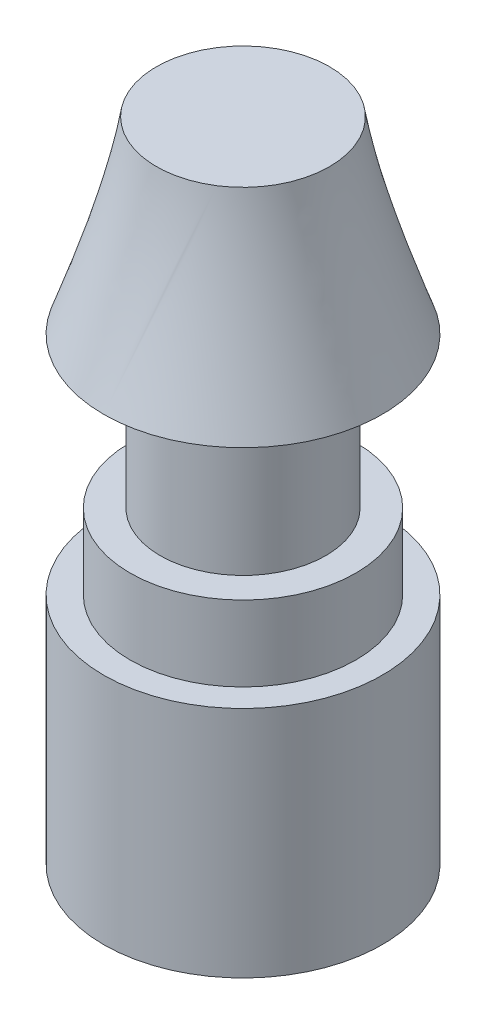
ISO-10303-21;
HEADER;
FILE_DESCRIPTION(('STEP AP214'),'2;1');
FILE_NAME('part.step','',(''),(''),'','','');
FILE_SCHEMA(('AUTOMOTIVE_DESIGN { 1 0 10303 214 1 1 1 1 }'));
ENDSEC;
DATA;
#1=APPLICATION_CONTEXT('core data for automotive mechanical design processes');
#2=APPLICATION_PROTOCOL_DEFINITION('international standard','automotive_design',2000,#1);
#3=PRODUCT_CONTEXT('',#1,'mechanical');
#4=PRODUCT('Part','Part','',(#3));
#5=PRODUCT_RELATED_PRODUCT_CATEGORY('part','',(#4));
#6=PRODUCT_DEFINITION_FORMATION('','',#4);
#7=PRODUCT_DEFINITION_CONTEXT('part definition',#1,'design');
#8=PRODUCT_DEFINITION('design','',#6,#7);
#9=PRODUCT_DEFINITION_SHAPE('','',#8);
#10=(LENGTH_UNIT() NAMED_UNIT(*) SI_UNIT(.MILLI.,.METRE.));
#11=(NAMED_UNIT(*) PLANE_ANGLE_UNIT() SI_UNIT($,.RADIAN.));
#12=(NAMED_UNIT(*) SI_UNIT($,.STERADIAN.) SOLID_ANGLE_UNIT());
#13=UNCERTAINTY_MEASURE_WITH_UNIT(LENGTH_MEASURE(1.E-05),#10,'distance_accuracy_value','');
#14=(GEOMETRIC_REPRESENTATION_CONTEXT(3) GLOBAL_UNCERTAINTY_ASSIGNED_CONTEXT((#13)) GLOBAL_UNIT_ASSIGNED_CONTEXT((#10,
#11,#12)) REPRESENTATION_CONTEXT('',''));
#15=CARTESIAN_POINT('',(0.,0.,0.));
#16=DIRECTION('',(0.,0.,1.));
#17=DIRECTION('',(1.,0.,0.));
#18=AXIS2_PLACEMENT_3D('',#15,#16,#17);
#19=CARTESIAN_POINT('',(0.,3.1,0.));
#20=DIRECTION('',(0.,-1.,0.));
#21=DIRECTION('',(0.,0.,-1.));
#22=AXIS2_PLACEMENT_3D('',#19,#20,#21);
#23=CYLINDRICAL_SURFACE('',#22,1.85);
#24=CARTESIAN_POINT('',(0.,3.1,0.));
#25=DIRECTION('',(0.,1.,0.));
#26=DIRECTION('',(0.,0.,1.));
#27=AXIS2_PLACEMENT_3D('',#24,#25,#26);
#28=CIRCLE('',#27,1.85);
#29=CARTESIAN_POINT('',(0.,3.1,-1.85));
#30=VERTEX_POINT('',#29);
#31=EDGE_CURVE('E47',#30,#30,#28,.T.);
#32=CARTESIAN_POINT('',(0.,0.,0.));
#33=DIRECTION('',(0.,1.,0.));
#34=DIRECTION('',(0.,0.,1.));
#35=AXIS2_PLACEMENT_3D('',#32,#33,#34);
#36=CIRCLE('',#35,1.85);
#37=CARTESIAN_POINT('',(0.,0.,-1.85));
#38=VERTEX_POINT('',#37);
#39=EDGE_CURVE('E38',#38,#38,#36,.T.);
#40=CARTESIAN_POINT('',(0.,3.1,-1.85));
#41=CARTESIAN_POINT('',(0.,3.06770833333333,-1.85));
#42=CARTESIAN_POINT('',(0.,3.03541666666667,-1.85));
#43=CARTESIAN_POINT('',(0.,2.97083333333333,-1.85));
#44=CARTESIAN_POINT('',(0.,2.93854166666667,-1.85));
#45=CARTESIAN_POINT('',(0.,2.87395833333333,-1.85));
#46=CARTESIAN_POINT('',(0.,2.84166666666667,-1.85));
#47=CARTESIAN_POINT('',(0.,2.77708333333333,-1.85));
#48=CARTESIAN_POINT('',(0.,2.74479166666667,-1.85));
#49=CARTESIAN_POINT('',(0.,2.68020833333333,-1.85));
#50=CARTESIAN_POINT('',(0.,2.64791666666667,-1.85));
#51=CARTESIAN_POINT('',(0.,2.58333333333333,-1.85));
#52=CARTESIAN_POINT('',(0.,2.55104166666667,-1.85));
#53=CARTESIAN_POINT('',(0.,2.48645833333333,-1.85));
#54=CARTESIAN_POINT('',(0.,2.45416666666667,-1.85));
#55=CARTESIAN_POINT('',(0.,2.38958333333333,-1.85));
#56=CARTESIAN_POINT('',(0.,2.35729166666667,-1.85));
#57=CARTESIAN_POINT('',(0.,2.29270833333333,-1.85));
#58=CARTESIAN_POINT('',(0.,2.26041666666667,-1.85));
#59=CARTESIAN_POINT('',(0.,2.19583333333333,-1.85));
#60=CARTESIAN_POINT('',(0.,2.16354166666667,-1.85));
#61=CARTESIAN_POINT('',(0.,2.09895833333333,-1.85));
#62=CARTESIAN_POINT('',(0.,2.06666666666667,-1.85));
#63=CARTESIAN_POINT('',(0.,2.00208333333333,-1.85));
#64=CARTESIAN_POINT('',(0.,1.96979166666667,-1.85));
#65=CARTESIAN_POINT('',(0.,1.90520833333333,-1.85));
#66=CARTESIAN_POINT('',(0.,1.87291666666667,-1.85));
#67=CARTESIAN_POINT('',(0.,1.80833333333333,-1.85));
#68=CARTESIAN_POINT('',(0.,1.77604166666667,-1.85));
#69=CARTESIAN_POINT('',(0.,1.71145833333333,-1.85));
#70=CARTESIAN_POINT('',(0.,1.67916666666667,-1.85));
#71=CARTESIAN_POINT('',(0.,1.61458333333333,-1.85));
#72=CARTESIAN_POINT('',(0.,1.58229166666667,-1.85));
#73=CARTESIAN_POINT('',(0.,1.51770833333333,-1.85));
#74=CARTESIAN_POINT('',(0.,1.48541666666667,-1.85));
#75=CARTESIAN_POINT('',(0.,1.42083333333333,-1.85));
#76=CARTESIAN_POINT('',(0.,1.38854166666667,-1.85));
#77=CARTESIAN_POINT('',(0.,1.32395833333333,-1.85));
#78=CARTESIAN_POINT('',(0.,1.29166666666667,-1.85));
#79=CARTESIAN_POINT('',(0.,1.22708333333333,-1.85));
#80=CARTESIAN_POINT('',(0.,1.19479166666667,-1.85));
#81=CARTESIAN_POINT('',(0.,1.13020833333333,-1.85));
#82=CARTESIAN_POINT('',(0.,1.09791666666667,-1.85));
#83=CARTESIAN_POINT('',(0.,1.03333333333333,-1.85));
#84=CARTESIAN_POINT('',(0.,1.00104166666667,-1.85));
#85=CARTESIAN_POINT('',(0.,0.936458333333333,-1.85));
#86=CARTESIAN_POINT('',(0.,0.904166666666667,-1.85));
#87=CARTESIAN_POINT('',(0.,0.839583333333333,-1.85));
#88=CARTESIAN_POINT('',(0.,0.807291666666667,-1.85));
#89=CARTESIAN_POINT('',(0.,0.742708333333333,-1.85));
#90=CARTESIAN_POINT('',(0.,0.710416666666667,-1.85));
#91=CARTESIAN_POINT('',(0.,0.645833333333333,-1.85));
#92=CARTESIAN_POINT('',(0.,0.613541666666667,-1.85));
#93=CARTESIAN_POINT('',(0.,0.548958333333333,-1.85));
#94=CARTESIAN_POINT('',(0.,0.516666666666667,-1.85));
#95=CARTESIAN_POINT('',(0.,0.452083333333333,-1.85));
#96=CARTESIAN_POINT('',(0.,0.419791666666667,-1.85));
#97=CARTESIAN_POINT('',(0.,0.355208333333333,-1.85));
#98=CARTESIAN_POINT('',(0.,0.322916666666667,-1.85));
#99=CARTESIAN_POINT('',(0.,0.258333333333333,-1.85));
#100=CARTESIAN_POINT('',(0.,0.226041666666667,-1.85));
#101=CARTESIAN_POINT('',(0.,0.161458333333333,-1.85));
#102=CARTESIAN_POINT('',(0.,0.129166666666667,-1.85));
#103=CARTESIAN_POINT('',(0.,0.0645833333333335,-1.85));
#104=CARTESIAN_POINT('',(0.,0.0322916666666667,-1.85));
#105=CARTESIAN_POINT('',(0.,0.,-1.85));
#106=B_SPLINE_CURVE_WITH_KNOTS('',3,(#40,#41,#42,#43,#44,#45,#46,#47,#48,#49,#50,#51,#52,#53,
#54,#55,#56,#57,#58,#59,#60,#61,#62,#63,#64,#65,#66,#67,#68,#69,#70,#71,#72,#73,#74,#75,#76,#77,
#78,#79,#80,#81,#82,#83,#84,#85,#86,#87,#88,#89,#90,#91,#92,#93,#94,#95,#96,#97,#98,#99,#100,
#101,#102,#103,#104,#105),.UNSPECIFIED.,.F.,.F.,(4,2,2,2,2,2,2,2,2,2,2,2,2,2,2,2,2,2,2,2,2,2,2,
2,2,2,2,2,2,2,2,2,4),(0.,0.0968749999999997,0.19375,0.290625,0.3875,0.484375,0.58125,0.678125,
0.775,0.871874999999999,0.96875,1.065625,1.1625,1.259375,1.35625,1.453125,1.55,1.646875,1.74375,
1.840625,1.9375,2.034375,2.13125,2.228125,2.325,2.421875,2.51875,2.615625,2.7125,2.809375,
2.90625,3.003125,3.1),.UNSPECIFIED.);
#107=EDGE_CURVE('BSEAM35',#30,#38,#106,.T.);
#108=ORIENTED_EDGE('',*,*,#31,.F.);
#109=ORIENTED_EDGE('',*,*,#39,.T.);
#110=ORIENTED_EDGE('',*,*,#107,.T.);
#111=ORIENTED_EDGE('',*,*,#107,.F.);
#112=EDGE_LOOP('',(#108,#110,#109,#111));
#113=FACE_BOUND('',#112,.T.);
#114=ADVANCED_FACE('F35',(#113),#23,.T.);
#115=CARTESIAN_POINT('',(0.,3.1,0.));
#116=DIRECTION('',(0.,1.,0.));
#117=DIRECTION('',(0.,0.,1.));
#118=AXIS2_PLACEMENT_3D('',#115,#116,#117);
#119=PLANE('',#118);
#120=CARTESIAN_POINT('',(0.,3.1,0.));
#121=DIRECTION('',(0.,1.,0.));
#122=DIRECTION('',(0.,0.,1.));
#123=AXIS2_PLACEMENT_3D('',#120,#121,#122);
#124=CIRCLE('',#123,1.5);
#125=CARTESIAN_POINT('',(0.,3.1,1.5));
#126=VERTEX_POINT('',#125);
#127=EDGE_CURVE('E42',#126,#126,#124,.T.);
#128=ORIENTED_EDGE('',*,*,#127,.F.);
#129=EDGE_LOOP('',(#128));
#130=FACE_BOUND('',#129,.T.);
#131=ORIENTED_EDGE('',*,*,#31,.T.);
#132=EDGE_LOOP('',(#131));
#133=FACE_BOUND('',#132,.T.);
#134=ADVANCED_FACE('F65',(#130,#133),#119,.T.);
#135=CARTESIAN_POINT('',(0.,0.,0.));
#136=DIRECTION('',(0.,1.,0.));
#137=DIRECTION('',(0.,0.,1.));
#138=AXIS2_PLACEMENT_3D('',#135,#136,#137);
#139=PLANE('',#138);
#140=ORIENTED_EDGE('',*,*,#39,.F.);
#141=EDGE_LOOP('',(#140));
#142=FACE_BOUND('',#141,.T.);
#143=ADVANCED_FACE('F62',(#142),#139,.F.);
#144=CARTESIAN_POINT('',(0.,4.1,0.));
#145=DIRECTION('',(0.,-1.,0.));
#146=DIRECTION('',(0.,0.,-1.));
#147=AXIS2_PLACEMENT_3D('',#144,#145,#146);
#148=CYLINDRICAL_SURFACE('',#147,1.5);
#149=CARTESIAN_POINT('',(0.,4.1,0.));
#150=DIRECTION('',(0.,1.,0.));
#151=DIRECTION('',(0.,0.,1.));
#152=AXIS2_PLACEMENT_3D('',#149,#150,#151);
#153=CIRCLE('',#152,1.5);
#154=CARTESIAN_POINT('',(0.,4.1,1.5));
#155=VERTEX_POINT('',#154);
#156=EDGE_CURVE('E53',#155,#155,#153,.T.);
#157=ORIENTED_EDGE('',*,*,#156,.F.);
#158=EDGE_LOOP('',(#157));
#159=FACE_BOUND('',#158,.T.);
#160=ORIENTED_EDGE('',*,*,#127,.T.);
#161=EDGE_LOOP('',(#160));
#162=FACE_BOUND('',#161,.T.);
#163=ADVANCED_FACE('F64',(#159,#162),#148,.T.);
#164=CARTESIAN_POINT('',(0.,4.1,0.));
#165=DIRECTION('',(0.,1.,0.));
#166=DIRECTION('',(0.,0.,1.));
#167=AXIS2_PLACEMENT_3D('',#164,#165,#166);
#168=PLANE('',#167);
#169=CARTESIAN_POINT('',(0.,4.1,0.));
#170=DIRECTION('',(0.,1.,0.));
#171=DIRECTION('',(0.,0.,1.));
#172=AXIS2_PLACEMENT_3D('',#169,#170,#171);
#173=CIRCLE('',#172,1.1);
#174=CARTESIAN_POINT('',(0.,4.1,1.1));
#175=VERTEX_POINT('',#174);
#176=EDGE_CURVE('E11',#175,#175,#173,.T.);
#177=ORIENTED_EDGE('',*,*,#176,.F.);
#178=EDGE_LOOP('',(#177));
#179=FACE_BOUND('',#178,.T.);
#180=ORIENTED_EDGE('',*,*,#156,.T.);
#181=EDGE_LOOP('',(#180));
#182=FACE_BOUND('',#181,.T.);
#183=ADVANCED_FACE('F70',(#179,#182),#168,.T.);
#184=CARTESIAN_POINT('',(0.,6.1,0.));
#185=DIRECTION('',(0.,-1.,0.));
#186=DIRECTION('',(0.,0.,-1.));
#187=AXIS2_PLACEMENT_3D('',#184,#185,#186);
#188=CYLINDRICAL_SURFACE('',#187,1.1);
#189=CARTESIAN_POINT('',(0.,6.1,0.));
#190=DIRECTION('',(0.,1.,0.));
#191=DIRECTION('',(0.,0.,1.));
#192=AXIS2_PLACEMENT_3D('',#189,#190,#191);
#193=CIRCLE('',#192,1.1);
#194=CARTESIAN_POINT('',(0.,6.1,1.1));
#195=VERTEX_POINT('',#194);
#196=EDGE_CURVE('E51',#195,#195,#193,.T.);
#197=ORIENTED_EDGE('',*,*,#196,.F.);
#198=EDGE_LOOP('',(#197));
#199=FACE_BOUND('',#198,.T.);
#200=ORIENTED_EDGE('',*,*,#176,.T.);
#201=EDGE_LOOP('',(#200));
#202=FACE_BOUND('',#201,.T.);
#203=ADVANCED_FACE('F100',(#199,#202),#188,.T.);
#204=CARTESIAN_POINT('',(0.,8.6,0.));
#205=DIRECTION('',(0.,1.,0.));
#206=DIRECTION('',(0.,0.,1.));
#207=AXIS2_PLACEMENT_3D('',#204,#205,#206);
#208=PLANE('',#207);
#209=CARTESIAN_POINT('',(0.,8.6,0.));
#210=DIRECTION('',(0.,1.,0.));
#211=DIRECTION('',(0.,0.,1.));
#212=AXIS2_PLACEMENT_3D('',#209,#210,#211);
#213=CIRCLE('',#212,1.15);
#214=CARTESIAN_POINT('',(0.620465420838555,8.6,0.968257538851949));
#215=VERTEX_POINT('',#214);
#216=EDGE_CURVE('E168',#215,#215,#213,.T.);
#217=ORIENTED_EDGE('',*,*,#216,.T.);
#218=EDGE_LOOP('',(#217));
#219=FACE_BOUND('',#218,.T.);
#220=ADVANCED_FACE('F110',(#219),#208,.T.);
#221=CARTESIAN_POINT('',(0.,6.1,0.));
#222=DIRECTION('',(0.,1.,0.));
#223=DIRECTION('',(0.,0.,1.));
#224=AXIS2_PLACEMENT_3D('',#221,#222,#223);
#225=PLANE('',#224);
#226=ORIENTED_EDGE('',*,*,#196,.T.);
#227=EDGE_LOOP('',(#226));
#228=FACE_BOUND('',#227,.T.);
#229=CARTESIAN_POINT('',(0.,6.1,0.));
#230=DIRECTION('',(0.,1.,0.));
#231=DIRECTION('',(0.,0.,1.));
#232=AXIS2_PLACEMENT_3D('',#229,#230,#231);
#233=CIRCLE('',#232,1.85);
#234=CARTESIAN_POINT('',(0.,6.1,1.85));
#235=VERTEX_POINT('',#234);
#236=EDGE_CURVE('E161',#235,#235,#233,.T.);
#237=ORIENTED_EDGE('',*,*,#236,.F.);
#238=EDGE_LOOP('',(#237));
#239=FACE_BOUND('',#238,.T.);
#240=ADVANCED_FACE('F120',(#228,#239),#225,.F.);
#241=CARTESIAN_POINT('',(0.,6.1,1.85));
#242=CARTESIAN_POINT('',(0.620465420838555,8.6,0.968257538851949));
#243=CARTESIAN_POINT('',(3.7,6.1,1.85));
#244=CARTESIAN_POINT('',(2.55698049854245,8.6,-0.272673302825161));
#245=CARTESIAN_POINT('',(3.7,6.1,-1.85));
#246=CARTESIAN_POINT('',(1.31604965686534,8.6,-2.20918838052906));
#247=CARTESIAN_POINT('',(0.,6.1,-1.85));
#248=CARTESIAN_POINT('',(-0.620465420838555,8.6,-0.96825753885195));
#249=CARTESIAN_POINT('',(-3.7,6.1,-1.85));
#250=CARTESIAN_POINT('',(-2.55698049854246,8.6,0.272673302825162));
#251=CARTESIAN_POINT('',(-3.7,6.1,1.85));
#252=CARTESIAN_POINT('',(-1.31604965686534,8.6,2.20918838052906));
#253=CARTESIAN_POINT('',(0.,6.1,1.85));
#254=CARTESIAN_POINT('',(0.620465420838555,8.6,0.968257538851949));
#255=(BOUNDED_SURFACE() B_SPLINE_SURFACE(3,1,((#241,#242),(#243,#244),(#245,#246),(#247,#248),
(#249,#250),(#251,#252),(#253,#254)),.UNSPECIFIED.,.T.,.F.,.F.) B_SPLINE_SURFACE_WITH_KNOTS((4,
3,4),(2,2),(0.,0.5,1.),(0.,1.),
.UNSPECIFIED.) GEOMETRIC_REPRESENTATION_ITEM() RATIONAL_B_SPLINE_SURFACE(((1.,1.),
(0.333333333333333,0.333333333333333),(0.333333333333333,0.333333333333333),(1.,1.),
(0.333333333333333,0.333333333333333),(0.333333333333333,0.333333333333333),(1.,1.))) REPRESENTATION_ITEM('') SURFACE());
#256=CARTESIAN_POINT('',(0.,6.1,1.85));
#257=CARTESIAN_POINT('',(0.00646318146706835,6.12604166666667,1.84081518269637));
#258=CARTESIAN_POINT('',(0.0129263629341366,6.15208333333333,1.83163036539275));
#259=CARTESIAN_POINT('',(0.0258527258682731,6.20416666666667,1.8132607307855));
#260=CARTESIAN_POINT('',(0.0323159073353414,6.23020833333333,1.80407591348187));
#261=CARTESIAN_POINT('',(0.045242270269478,6.28229166666667,1.78570627887462));
#262=CARTESIAN_POINT('',(0.0517054517365463,6.30833333333333,1.776521461571));
#263=CARTESIAN_POINT('',(0.0646318146706829,6.36041666666667,1.75815182696374));
#264=CARTESIAN_POINT('',(0.0710949961377511,6.38645833333333,1.74896700966012));
#265=CARTESIAN_POINT('',(0.0840213590718877,6.43854166666667,1.73059737505287));
#266=CARTESIAN_POINT('',(0.090484540538956,6.46458333333333,1.72141255774924));
#267=CARTESIAN_POINT('',(0.103410903473093,6.51666666666667,1.70304292314199));
#268=CARTESIAN_POINT('',(0.109874084940161,6.54270833333333,1.69385810583837));
#269=CARTESIAN_POINT('',(0.122800447874297,6.59479166666667,1.67548847123112));
#270=CARTESIAN_POINT('',(0.129263629341366,6.62083333333333,1.66630365392749));
#271=CARTESIAN_POINT('',(0.142189992275502,6.67291666666667,1.64793401932024));
#272=CARTESIAN_POINT('',(0.148653173742571,6.69895833333333,1.63874920201661));
#273=CARTESIAN_POINT('',(0.161579536676707,6.75104166666667,1.62037956740936));
#274=CARTESIAN_POINT('',(0.168042718143775,6.77708333333333,1.61119475010574));
#275=CARTESIAN_POINT('',(0.180969081077912,6.82916666666667,1.59282511549849));
#276=CARTESIAN_POINT('',(0.18743226254498,6.85520833333333,1.58364029819486));
#277=CARTESIAN_POINT('',(0.200358625479117,6.90729166666667,1.56527066358761));
#278=CARTESIAN_POINT('',(0.206821806946185,6.93333333333333,1.55608584628398));
#279=CARTESIAN_POINT('',(0.219748169880322,6.98541666666667,1.53771621167673));
#280=CARTESIAN_POINT('',(0.22621135134739,7.01145833333333,1.52853139437311));
#281=CARTESIAN_POINT('',(0.239137714281527,7.06354166666667,1.51016175976586));
#282=CARTESIAN_POINT('',(0.245600895748595,7.08958333333333,1.50097694246223));
#283=CARTESIAN_POINT('',(0.258527258682731,7.14166666666667,1.48260730785498));
#284=CARTESIAN_POINT('',(0.2649904401498,7.16770833333333,1.47342249055135));
#285=CARTESIAN_POINT('',(0.277916803083936,7.21979166666667,1.4550528559441));
#286=CARTESIAN_POINT('',(0.284379984551005,7.24583333333333,1.44586803864048));
#287=CARTESIAN_POINT('',(0.297306347485141,7.29791666666667,1.42749840403323));
#288=CARTESIAN_POINT('',(0.303769528952209,7.32395833333333,1.4183135867296));
#289=CARTESIAN_POINT('',(0.316695891886346,7.37604166666667,1.39994395212235));
#290=CARTESIAN_POINT('',(0.323159073353414,7.40208333333333,1.39075913481872));
#291=CARTESIAN_POINT('',(0.336085436287551,7.45416666666667,1.37238950021147));
#292=CARTESIAN_POINT('',(0.342548617754619,7.48020833333333,1.36320468290785));
#293=CARTESIAN_POINT('',(0.355474980688756,7.53229166666667,1.3448350483006));
#294=CARTESIAN_POINT('',(0.361938162155824,7.55833333333333,1.33565023099697));
#295=CARTESIAN_POINT('',(0.374864525089961,7.61041666666667,1.31728059638972));
#296=CARTESIAN_POINT('',(0.381327706557029,7.63645833333333,1.30809577908609));
#297=CARTESIAN_POINT('',(0.394254069491165,7.68854166666667,1.28972614447884));
#298=CARTESIAN_POINT('',(0.400717250958234,7.71458333333333,1.28054132717522));
#299=CARTESIAN_POINT('',(0.41364361389237,7.76666666666667,1.26217169256797));
#300=CARTESIAN_POINT('',(0.420106795359439,7.79270833333333,1.25298687526434));
#301=CARTESIAN_POINT('',(0.433033158293575,7.84479166666667,1.23461724065709));
#302=CARTESIAN_POINT('',(0.439496339760643,7.87083333333333,1.22543242335346));
#303=CARTESIAN_POINT('',(0.45242270269478,7.92291666666667,1.20706278874621));
#304=CARTESIAN_POINT('',(0.458885884161848,7.94895833333333,1.19787797144259));
#305=CARTESIAN_POINT('',(0.471812247095985,8.00104166666667,1.17950833683534));
#306=CARTESIAN_POINT('',(0.478275428563053,8.02708333333333,1.17032351953171));
#307=CARTESIAN_POINT('',(0.49120179149719,8.07916666666667,1.15195388492446));
#308=CARTESIAN_POINT('',(0.497664972964258,8.10520833333333,1.14276906762083));
#309=CARTESIAN_POINT('',(0.510591335898395,8.15729166666667,1.12439943301358));
#310=CARTESIAN_POINT('',(0.517054517365463,8.18333333333333,1.11521461570996));
#311=CARTESIAN_POINT('',(0.529980880299599,8.23541666666667,1.09684498110271));
#312=CARTESIAN_POINT('',(0.536444061766668,8.26145833333333,1.08766016379908));
#313=CARTESIAN_POINT('',(0.549370424700804,8.31354166666667,1.06929052919183));
#314=CARTESIAN_POINT('',(0.555833606167872,8.33958333333333,1.0601057118882));
#315=CARTESIAN_POINT('',(0.568759969102009,8.39166666666667,1.04173607728095));
#316=CARTESIAN_POINT('',(0.575223150569077,8.41770833333333,1.03255125997733));
#317=CARTESIAN_POINT('',(0.588149513503214,8.46979166666667,1.01418162537008));
#318=CARTESIAN_POINT('',(0.594612694970282,8.49583333333333,1.00499680806645));
#319=CARTESIAN_POINT('',(0.607539057904419,8.54791666666667,0.9866271734592));
#320=CARTESIAN_POINT('',(0.614002239371487,8.57395833333333,0.977442356155575));
#321=CARTESIAN_POINT('',(0.620465420838555,8.6,0.968257538851949));
#322=B_SPLINE_CURVE_WITH_KNOTS('',3,(#256,#257,#258,#259,#260,#261,#262,#263,#264,#265,#266,
#267,#268,#269,#270,#271,#272,#273,#274,#275,#276,#277,#278,#279,#280,#281,#282,#283,#284,#285,
#286,#287,#288,#289,#290,#291,#292,#293,#294,#295,#296,#297,#298,#299,#300,#301,#302,#303,#304,
#305,#306,#307,#308,#309,#310,#311,#312,#313,#314,#315,#316,#317,#318,#319,#320,#321),
.UNSPECIFIED.,.F.,.F.,(4,2,2,2,2,2,2,2,2,2,2,2,2,2,2,2,2,2,2,2,2,2,2,2,2,2,2,2,2,2,2,2,4),(0.,
0.0850806551290898,0.17016131025818,0.255241965387269,0.340322620516359,0.425403275645449,
0.510483930774539,0.595564585903629,0.680645241032718,0.765725896161807,0.850806551290897,
0.935887206419988,1.02096786154908,1.10604851667817,1.19112917180726,1.27620982693635,
1.36129048206544,1.44637113719453,1.53145179232361,1.6165324474527,1.70161310258179,
1.78669375771088,1.87177441283997,1.95685506796906,2.04193572309815,2.12701637822724,
2.21209703335633,2.29717768848542,2.38225834361451,2.4673389987436,2.55241965387269,
2.63750030900178,2.72258096413087),.UNSPECIFIED.);
#323=EDGE_CURVE('BSEAM130',#235,#215,#322,.T.);
#324=ORIENTED_EDGE('',*,*,#236,.T.);
#325=ORIENTED_EDGE('',*,*,#216,.F.);
#326=ORIENTED_EDGE('',*,*,#323,.T.);
#327=ORIENTED_EDGE('',*,*,#323,.F.);
#328=EDGE_LOOP('',(#324,#326,#325,#327));
#329=FACE_BOUND('',#328,.T.);
#330=ADVANCED_FACE('F130',(#329),#255,.T.);
#331=CLOSED_SHELL('',(#114,#134,#143,#163,#183,#203,#220,#240,#330));
#332=MANIFOLD_SOLID_BREP('B2',#331);
#333=ADVANCED_BREP_SHAPE_REPRESENTATION('',(#18,#332),#14);
#334=SHAPE_DEFINITION_REPRESENTATION(#9,#333);
ENDSEC;
END-ISO-10303-21;
